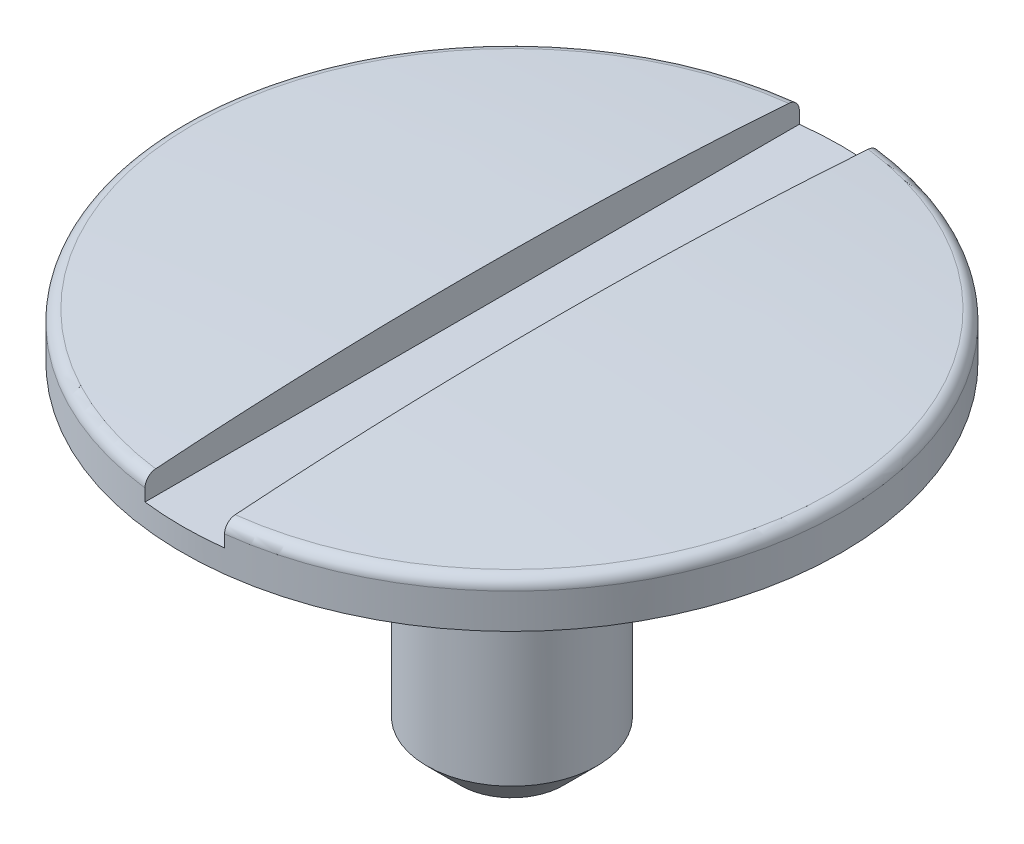
ISO-10303-21;
HEADER;
FILE_DESCRIPTION(('STEP AP214'),'2;1');
FILE_NAME('part.step','',(''),(''),'','','');
FILE_SCHEMA(('AUTOMOTIVE_DESIGN { 1 0 10303 214 1 1 1 1 }'));
ENDSEC;
DATA;
#1=APPLICATION_CONTEXT('core data for automotive mechanical design processes');
#2=APPLICATION_PROTOCOL_DEFINITION('international standard','automotive_design',2000,#1);
#3=PRODUCT_CONTEXT('',#1,'mechanical');
#4=PRODUCT('Part','Part','',(#3));
#5=PRODUCT_RELATED_PRODUCT_CATEGORY('part','',(#4));
#6=PRODUCT_DEFINITION_FORMATION('','',#4);
#7=PRODUCT_DEFINITION_CONTEXT('part definition',#1,'design');
#8=PRODUCT_DEFINITION('design','',#6,#7);
#9=PRODUCT_DEFINITION_SHAPE('','',#8);
#10=(LENGTH_UNIT() NAMED_UNIT(*) SI_UNIT(.MILLI.,.METRE.));
#11=(NAMED_UNIT(*) PLANE_ANGLE_UNIT() SI_UNIT($,.RADIAN.));
#12=(NAMED_UNIT(*) SI_UNIT($,.STERADIAN.) SOLID_ANGLE_UNIT());
#13=UNCERTAINTY_MEASURE_WITH_UNIT(LENGTH_MEASURE(1.E-05),#10,'distance_accuracy_value','');
#14=(GEOMETRIC_REPRESENTATION_CONTEXT(3) GLOBAL_UNCERTAINTY_ASSIGNED_CONTEXT((#13)) GLOBAL_UNIT_ASSIGNED_CONTEXT((#10,
#11,#12)) REPRESENTATION_CONTEXT('',''));
#15=CARTESIAN_POINT('',(0.,0.,0.));
#16=DIRECTION('',(0.,0.,1.));
#17=DIRECTION('',(1.,0.,0.));
#18=AXIS2_PLACEMENT_3D('',#15,#16,#17);
#19=CARTESIAN_POINT('',(0.,-19.7473682474656,0.));
#20=DIRECTION('',(0.,-1.,0.));
#21=DIRECTION('',(1.,0.,0.));
#22=AXIS2_PLACEMENT_3D('',#19,#20,#21);
#23=SPHERICAL_SURFACE('',#22,20.0000000000012);
#24=CARTESIAN_POINT('',(0.175000000002913,-19.7473682474656,0.));
#25=DIRECTION('',(1.,1.44957830461334E-13,0.));
#26=DIRECTION('',(-1.44957830461334E-13,1.,0.));
#27=AXIS2_PLACEMENT_3D('',#24,#25,#26);
#28=CIRCLE('',#27,19.9992343603461);
#29=CARTESIAN_POINT('',(0.175000000000021,0.203325051946489,1.39255587781734));
#30=VERTEX_POINT('',#29);
#31=CARTESIAN_POINT('',(0.175000000000021,0.203325051946445,-1.39255587781736));
#32=VERTEX_POINT('',#31);
#33=EDGE_CURVE('E109',#30,#32,#28,.F.);
#34=ORIENTED_EDGE('',*,*,#33,.F.);
#35=CARTESIAN_POINT('',(0.,0.203325051946444,0.));
#36=DIRECTION('',(0.,-1.,0.));
#37=DIRECTION('',(1.,0.,0.));
#38=AXIS2_PLACEMENT_3D('',#35,#36,#37);
#39=CIRCLE('',#38,1.40350877191546);
#40=EDGE_CURVE('E126',#30,#32,#39,.F.);
#41=ORIENTED_EDGE('',*,*,#40,.T.);
#42=EDGE_LOOP('',(#34,#41));
#43=FACE_BOUND('',#42,.T.);
#44=ADVANCED_FACE('F35',(#43),#23,.T.);
#45=CARTESIAN_POINT('',(0.,0.153448318697961,0.));
#46=DIRECTION('',(0.,-1.,0.));
#47=DIRECTION('',(1.,0.,0.));
#48=AXIS2_PLACEMENT_3D('',#45,#46,#47);
#49=TOROIDAL_SURFACE('',#48,1.39999999998568,0.05);
#50=CARTESIAN_POINT('',(0.175000000000024,0.180891636046044,-1.43113566144709));
#51=CARTESIAN_POINT('',(0.175000000000025,0.178560281061544,-1.43267770724129));
#52=CARTESIAN_POINT('',(0.175000000000025,0.176097582226159,-1.43402472347457));
#53=CARTESIAN_POINT('',(0.175000000000026,0.170979124220363,-1.43628758780099));
#54=CARTESIAN_POINT('',(0.175000000000026,0.168323150977832,-1.43720294913421));
#55=CARTESIAN_POINT('',(0.175000000000027,0.162895618780364,-1.43857383147017));
#56=CARTESIAN_POINT('',(0.175000000000028,0.160124094582384,-1.43902948972413));
#57=CARTESIAN_POINT('',(0.175000000000028,0.154544602146341,-1.43946763476279));
#58=CARTESIAN_POINT('',(0.175000000000029,0.151736642780538,-1.4394502346573));
#59=CARTESIAN_POINT('',(0.17500000000003,0.146170024697078,-1.43894369998403));
#60=CARTESIAN_POINT('',(0.17500000000003,0.14341126893163,-1.43845563124171));
#61=CARTESIAN_POINT('',(0.175000000000031,0.13801464336625,-1.43702370948892));
#62=CARTESIAN_POINT('',(0.175000000000031,0.13537677775096,-1.43607984071384));
#63=CARTESIAN_POINT('',(0.175000000000032,0.130293560142586,-1.4337627904083));
#64=CARTESIAN_POINT('',(0.175000000000032,0.127848414465937,-1.43238915640251));
#65=CARTESIAN_POINT('',(0.175000000000033,0.123221889741078,-1.42925288251512));
#66=CARTESIAN_POINT('',(0.175000000000033,0.121040516092855,-1.42749023467164));
#67=CARTESIAN_POINT('',(0.175000000000034,0.116991075627887,-1.42361656091314));
#68=CARTESIAN_POINT('',(0.175000000000034,0.115124687197054,-1.42150378071808));
#69=CARTESIAN_POINT('',(0.175000000000035,0.111770057388856,-1.41699680295985));
#70=CARTESIAN_POINT('',(0.175000000000035,0.110281829491109,-1.41460259536958));
#71=CARTESIAN_POINT('',(0.175000000000035,0.107714338923366,-1.40958218299511));
#72=CARTESIAN_POINT('',(0.175000000000035,0.10663811509622,-1.40695442408408));
#73=CARTESIAN_POINT('',(0.175000000000036,0.104938932971271,-1.40155622917851));
#74=CARTESIAN_POINT('',(0.175000000000036,0.104315992393513,-1.39878578761064));
#75=CARTESIAN_POINT('',(0.175000000000036,0.103537460797932,-1.39316193157017));
#76=CARTESIAN_POINT('',(0.175000000000036,0.103384877713837,-1.39030810041072));
#77=CARTESIAN_POINT('',(0.175000000000036,0.103559548266404,-1.38461512584935));
#78=CARTESIAN_POINT('',(0.175000000000036,0.103886812656071,-1.38177598277802));
#79=CARTESIAN_POINT('',(0.175000000000036,0.105013813089805,-1.3761849025975));
#80=CARTESIAN_POINT('',(0.175000000000035,0.105814840983795,-1.37343322568985));
#81=CARTESIAN_POINT('',(0.175000000000035,0.107868545203982,-1.36810385594301));
#82=CARTESIAN_POINT('',(0.175000000000035,0.109121219523854,-1.36552616233101));
#83=CARTESIAN_POINT('',(0.175000000000034,0.112040281181247,-1.36062493039321));
#84=CARTESIAN_POINT('',(0.175000000000034,0.11370568624035,-1.35830080722965));
#85=CARTESIAN_POINT('',(0.175000000000034,0.117405472671899,-1.35396752925418));
#86=CARTESIAN_POINT('',(0.175000000000033,0.119439841965097,-1.3519583641351));
#87=CARTESIAN_POINT('',(0.175000000000033,0.123805502865695,-1.34832671730377));
#88=CARTESIAN_POINT('',(0.175000000000032,0.126134717532373,-1.34670173917914));
#89=CARTESIAN_POINT('',(0.175000000000032,0.131034679756063,-1.34386963135274));
#90=CARTESIAN_POINT('',(0.175000000000031,0.133605416067243,-1.34266248220809));
#91=CARTESIAN_POINT('',(0.175000000000031,0.138893129670516,-1.34071036522845));
#92=CARTESIAN_POINT('',(0.17500000000003,0.141608758292212,-1.33996174364333));
#93=CARTESIAN_POINT('',(0.175000000000029,0.147127424117034,-1.33893393888391));
#94=CARTESIAN_POINT('',(0.175000000000029,0.149930458020146,-1.33865473800827));
#95=CARTESIAN_POINT('',(0.175000000000028,0.155527503093241,-1.3385744043236));
#96=CARTESIAN_POINT('',(0.175000000000028,0.158321476116973,-1.33877058680354));
#97=CARTESIAN_POINT('',(0.175000000000027,0.163836713163342,-1.33962951909531));
#98=CARTESIAN_POINT('',(0.175000000000027,0.16655797792858,-1.34029226414005));
#99=CARTESIAN_POINT('',(0.175000000000026,0.171849584425983,-1.34206416908961));
#100=CARTESIAN_POINT('',(0.175000000000025,0.174419995271844,-1.34317312270541));
#101=CARTESIAN_POINT('',(0.175000000000025,0.179339407662948,-1.34580479446419));
#102=CARTESIAN_POINT('',(0.175000000000024,0.181688405015702,-1.34732752043988));
#103=CARTESIAN_POINT('',(0.175000000000024,0.186111015737406,-1.35075096036927));
#104=CARTESIAN_POINT('',(0.175000000000023,0.188183224736419,-1.35265348818655));
#105=CARTESIAN_POINT('',(0.175000000000023,0.191981899679696,-1.35677700850719));
#106=CARTESIAN_POINT('',(0.175000000000023,0.193708351131309,-1.35899801435307));
#107=CARTESIAN_POINT('',(0.175000000000022,0.196780973781055,-1.36371412108633));
#108=CARTESIAN_POINT('',(0.175000000000022,0.198124044725907,-1.36621124184268));
#109=CARTESIAN_POINT('',(0.175000000000022,0.200375354166497,-1.37139435766703));
#110=CARTESIAN_POINT('',(0.175000000000022,0.20128357366268,-1.37408036098181));
#111=CARTESIAN_POINT('',(0.175000000000021,0.202645707273805,-1.37958580446009));
#112=CARTESIAN_POINT('',(0.175000000000021,0.203096298546881,-1.38240606709144));
#113=CARTESIAN_POINT('',(0.175000000000021,0.203519348037031,-1.38808215288261));
#114=CARTESIAN_POINT('',(0.175000000000021,0.203491812631285,-1.39093797556762));
#115=CARTESIAN_POINT('',(0.175000000000021,0.202958379659298,-1.39661400198807));
#116=CARTESIAN_POINT('',(0.175000000000021,0.20245092884452,-1.3994340599262));
#117=CARTESIAN_POINT('',(0.175000000000022,0.200968780987697,-1.40494946643022));
#118=CARTESIAN_POINT('',(0.175000000000022,0.199993969518579,-1.40764478427786));
#119=CARTESIAN_POINT('',(0.175000000000022,0.197605494651212,-1.41282894344985));
#120=CARTESIAN_POINT('',(0.175000000000022,0.196192400025502,-1.41531804710986));
#121=CARTESIAN_POINT('',(0.175000000000023,0.192966881760539,-1.42001948105551));
#122=CARTESIAN_POINT('',(0.175000000000023,0.191154951031286,-1.42223214773616));
#123=CARTESIAN_POINT('',(0.175000000000023,0.187918431007408,-1.42556201070716));
#124=CARTESIAN_POINT('',(0.175000000000024,0.186597857452183,-1.42678202620635));
#125=CARTESIAN_POINT('',(0.175000000000024,0.183833477621244,-1.42907342283929));
#126=CARTESIAN_POINT('',(0.175000000000024,0.182389671684978,-1.43014480438246));
#127=CARTESIAN_POINT('',(0.175000000000024,0.180891636046044,-1.43113566144709));
#128=B_SPLINE_CURVE_WITH_KNOTS('',3,(#50,#51,#52,#53,#54,#55,#56,#57,#58,#59,#60,#61,#62,#63,
#64,#65,#66,#67,#68,#69,#70,#71,#72,#73,#74,#75,#76,#77,#78,#79,#80,#81,#82,#83,#84,#85,#86,#87,
#88,#89,#90,#91,#92,#93,#94,#95,#96,#97,#98,#99,#100,#101,#102,#103,#104,#105,#106,#107,#108,
#109,#110,#111,#112,#113,#114,#115,#116,#117,#118,#119,#120,#121,#122,#123,#124,#125,#126,#127),
.UNSPECIFIED.,.T.,.F.,(4,2,2,2,2,2,2,2,2,2,2,2,2,2,2,2,2,2,2,2,2,2,2,2,2,2,2,2,2,2,2,2,2,2,2,2,
2,2,4),(0.,0.00837907339395287,0.0167675730710051,0.0251535674945092,0.0335375568167555,
0.0419026051341589,0.0502679427914296,0.0586421176436145,0.0670164639043773,0.0754341126133647,
0.0838520613292566,0.0923309545325715,0.100810179180546,0.10934351710766,0.117877046263093,
0.12643395247592,0.134990820677299,0.143527516309482,0.152063932515497,0.160543253791542,
0.169022180445353,0.177432633082565,0.185842768563927,0.194205518899811,0.202568183790649,
0.210926986928206,0.219285948308838,0.227685829073255,0.236086061850465,0.244552415110739,
0.253019138249669,0.261546908040078,0.270074564088494,0.278629914730998,0.287187361108461,
0.295733748383548,0.304269632143488,0.309653705020939,0.315037763068224),.UNSPECIFIED.);
#129=CARTESIAN_POINT('',(0.175000000000028,0.153448318698008,-1.4394009170341));
#130=VERTEX_POINT('',#129);
#131=EDGE_CURVE('E58',#32,#130,#128,.T.);
#132=ORIENTED_EDGE('',*,*,#131,.F.);
#133=ORIENTED_EDGE('',*,*,#40,.F.);
#134=CARTESIAN_POINT('',(0.175000000000025,0.175067090841669,1.34356634174732));
#135=CARTESIAN_POINT('',(0.175000000000026,0.172556157848946,1.34235227782851));
#136=CARTESIAN_POINT('',(0.175000000000026,0.169941282906867,1.34134869640238));
#137=CARTESIAN_POINT('',(0.175000000000027,0.164578095586884,1.33979383856907));
#138=CARTESIAN_POINT('',(0.175000000000027,0.161829636420155,1.33924307220805));
#139=CARTESIAN_POINT('',(0.175000000000028,0.156279928296398,1.33861163602454));
#140=CARTESIAN_POINT('',(0.175000000000028,0.153478697925862,1.33853080368167));
#141=CARTESIAN_POINT('',(0.175000000000029,0.147903271917639,1.33884137072952));
#142=CARTESIAN_POINT('',(0.17500000000003,0.145129070087395,1.33923265925875));
#143=CARTESIAN_POINT('',(0.17500000000003,0.139689197010661,1.3404747462751));
#144=CARTESIAN_POINT('',(0.175000000000031,0.137023395084223,1.34132497270266));
#145=CARTESIAN_POINT('',(0.175000000000032,0.131871564016762,1.34345943224581));
#146=CARTESIAN_POINT('',(0.175000000000032,0.129385543296285,1.34474368567428));
#147=CARTESIAN_POINT('',(0.175000000000033,0.124654292698374,1.34771378293724));
#148=CARTESIAN_POINT('',(0.175000000000033,0.122409924948726,1.34940099972761));
#149=CARTESIAN_POINT('',(0.175000000000034,0.118233694500287,1.35312574649911));
#150=CARTESIAN_POINT('',(0.175000000000034,0.116301842520982,1.35516328849168));
#151=CARTESIAN_POINT('',(0.175000000000034,0.112790160259404,1.35954674540898));
#152=CARTESIAN_POINT('',(0.175000000000035,0.111213024724992,1.3618948190153));
#153=CARTESIAN_POINT('',(0.175000000000035,0.108471780484804,1.36682079016142));
#154=CARTESIAN_POINT('',(0.175000000000035,0.107307688985756,1.3693986972701));
#155=CARTESIAN_POINT('',(0.175000000000035,0.105416411048964,1.37473271045428));
#156=CARTESIAN_POINT('',(0.175000000000036,0.104692691395389,1.37749004603199));
#157=CARTESIAN_POINT('',(0.175000000000036,0.103716003995072,1.38308689177576));
#158=CARTESIAN_POINT('',(0.175000000000036,0.103463051631074,1.38592640462397));
#159=CARTESIAN_POINT('',(0.175000000000036,0.103434772548715,1.39162125044477));
#160=CARTESIAN_POINT('',(0.175000000000036,0.10366170123626,1.39447659493407));
#161=CARTESIAN_POINT('',(0.175000000000036,0.10459179399141,1.40010868408785));
#162=CARTESIAN_POINT('',(0.175000000000035,0.105294960919559,1.40288542828011));
#163=CARTESIAN_POINT('',(0.175000000000035,0.10715826792202,1.40828033104081));
#164=CARTESIAN_POINT('',(0.175000000000035,0.108318282595621,1.41089853290039));
#165=CARTESIAN_POINT('',(0.175000000000035,0.111063496742903,1.41590169790733));
#166=CARTESIAN_POINT('',(0.175000000000034,0.112648687276086,1.41828666595763));
#167=CARTESIAN_POINT('',(0.175000000000034,0.116191366897031,1.42274279249504));
#168=CARTESIAN_POINT('',(0.175000000000034,0.118146991689346,1.42481543286268));
#169=CARTESIAN_POINT('',(0.175000000000033,0.122380707022045,1.42860003016995));
#170=CARTESIAN_POINT('',(0.175000000000033,0.124658785078175,1.43031200106704));
#171=CARTESIAN_POINT('',(0.175000000000032,0.129455047604575,1.43331344436886));
#172=CARTESIAN_POINT('',(0.175000000000032,0.131971371401962,1.43460589013499));
#173=CARTESIAN_POINT('',(0.175000000000031,0.137186290917626,1.43674680526891));
#174=CARTESIAN_POINT('',(0.17500000000003,0.139884879516075,1.43759529196781));
#175=CARTESIAN_POINT('',(0.17500000000003,0.145368875207367,1.43881891645228));
#176=CARTESIAN_POINT('',(0.175000000000029,0.148153604658957,1.43919709252355));
#177=CARTESIAN_POINT('',(0.175000000000028,0.153746946731911,1.43947893957385));
#178=CARTESIAN_POINT('',(0.175000000000028,0.156555558786953,1.43938262177324));
#179=CARTESIAN_POINT('',(0.175000000000027,0.162107722224546,1.4387194136826));
#180=CARTESIAN_POINT('',(0.175000000000027,0.164851449065259,1.43815399062373));
#181=CARTESIAN_POINT('',(0.175000000000026,0.170205235362731,1.43657117717517));
#182=CARTESIAN_POINT('',(0.175000000000026,0.172815294678449,1.4355537863086));
#183=CARTESIAN_POINT('',(0.175000000000025,0.177832092465727,1.43309504884698));
#184=CARTESIAN_POINT('',(0.175000000000025,0.180238529427037,1.43165308724508));
#185=CARTESIAN_POINT('',(0.175000000000024,0.184776861563309,1.42838768448682));
#186=CARTESIAN_POINT('',(0.175000000000024,0.186908750459584,1.42656423460865));
#187=CARTESIAN_POINT('',(0.175000000000023,0.19085015946654,1.4225773189605));
#188=CARTESIAN_POINT('',(0.175000000000023,0.192657863912135,1.42041205849629));
#189=CARTESIAN_POINT('',(0.175000000000022,0.19588723280272,1.41581063608749));
#190=CARTESIAN_POINT('',(0.175000000000022,0.197308881864106,1.413374463353));
#191=CARTESIAN_POINT('',(0.175000000000022,0.19973670970894,1.40828137823557));
#192=CARTESIAN_POINT('',(0.175000000000022,0.200739786888427,1.40562298728672));
#193=CARTESIAN_POINT('',(0.175000000000021,0.202288493763778,1.40017613028651));
#194=CARTESIAN_POINT('',(0.175000000000021,0.202834105517654,1.39738765913789));
#195=CARTESIAN_POINT('',(0.175000000000021,0.203455309129993,1.39174131798859));
#196=CARTESIAN_POINT('',(0.175000000000021,0.203527969275428,1.38888312515113));
#197=CARTESIAN_POINT('',(0.175000000000021,0.20319364384115,1.38319499960048));
#198=CARTESIAN_POINT('',(0.175000000000021,0.202786666749516,1.38036506638809));
#199=CARTESIAN_POINT('',(0.175000000000022,0.201502748924458,1.37480716258592));
#200=CARTESIAN_POINT('',(0.175000000000022,0.20062475804367,1.37207943446232));
#201=CARTESIAN_POINT('',(0.175000000000022,0.198421770971058,1.36680995287128));
#202=CARTESIAN_POINT('',(0.175000000000022,0.197096667322328,1.36426824428973));
#203=CARTESIAN_POINT('',(0.175000000000023,0.19403990709189,1.359450824216));
#204=CARTESIAN_POINT('',(0.175000000000023,0.192309194032555,1.35717451348824));
#205=CARTESIAN_POINT('',(0.175000000000023,0.188488877135831,1.35294953272031));
#206=CARTESIAN_POINT('',(0.175000000000024,0.186399720955243,1.35100045993137));
#207=CARTESIAN_POINT('',(0.175000000000024,0.182753424626422,1.3481379195084));
#208=CARTESIAN_POINT('',(0.175000000000024,0.181285900780818,1.34710828946503));
#209=CARTESIAN_POINT('',(0.175000000000025,0.178248900638886,1.34521229148411));
#210=CARTESIAN_POINT('',(0.175000000000025,0.176679424673388,1.34434592301684));
#211=CARTESIAN_POINT('',(0.175000000000025,0.175067090841669,1.34356634174732));
#212=B_SPLINE_CURVE_WITH_KNOTS('',3,(#134,#135,#136,#137,#138,#139,#140,#141,#142,#143,#144,
#145,#146,#147,#148,#149,#150,#151,#152,#153,#154,#155,#156,#157,#158,#159,#160,#161,#162,#163,
#164,#165,#166,#167,#168,#169,#170,#171,#172,#173,#174,#175,#176,#177,#178,#179,#180,#181,#182,
#183,#184,#185,#186,#187,#188,#189,#190,#191,#192,#193,#194,#195,#196,#197,#198,#199,#200,#201,
#202,#203,#204,#205,#206,#207,#208,#209,#210,#211),.UNSPECIFIED.,.T.,.F.,(4,2,2,2,2,2,2,2,2,2,2,
2,2,2,2,2,2,2,2,2,2,2,2,2,2,2,2,2,2,2,2,2,2,2,2,2,2,2,4),(0.,0.00836061225485666,
0.0167306289637,0.025097750842039,0.0334629083690153,0.0418176628436744,0.0501728083830814,
0.0585568377831628,0.0669411546997118,0.0753871630109144,0.0838335231274777,0.0923455439902202,
0.100857842986018,0.109410238059464,0.11796268450365,0.126512785010478,0.135062705741898,
0.143570688386908,0.152078341722883,0.160524309591593,0.16896994772522,0.177360737322396,
0.185751328503124,0.194115774742446,0.202480229807466,0.21085686121662,0.219233684158382,
0.227656050075539,0.23607875155941,0.244562801886651,0.253047184946369,0.261584110968788,
0.270120885916571,0.278676773590984,0.28723471901214,0.295772951277712,0.304300596814887,
0.309669175654578,0.315037737074358),.UNSPECIFIED.);
#213=CARTESIAN_POINT('',(0.175000000000028,0.153448318698118,1.43940091703489));
#214=VERTEX_POINT('',#213);
#215=EDGE_CURVE('E160',#214,#30,#212,.T.);
#216=ORIENTED_EDGE('',*,*,#215,.F.);
#217=CARTESIAN_POINT('',(0.,0.153448318698013,0.));
#218=DIRECTION('',(0.,-1.,0.));
#219=DIRECTION('',(1.,0.,0.));
#220=AXIS2_PLACEMENT_3D('',#217,#218,#219);
#221=CIRCLE('',#220,1.44999999998568);
#222=EDGE_CURVE('E123',#130,#214,#221,.T.);
#223=ORIENTED_EDGE('',*,*,#222,.F.);
#224=EDGE_LOOP('',(#132,#133,#216,#223));
#225=FACE_BOUND('',#224,.T.);
#226=ADVANCED_FACE('F176',(#225),#49,.T.);
#227=CARTESIAN_POINT('',(-0.175000000002913,-19.7473682474656,0.));
#228=DIRECTION('',(-1.,1.44957830461334E-13,0.));
#229=DIRECTION('',(-1.44957830461334E-13,-1.,0.));
#230=AXIS2_PLACEMENT_3D('',#227,#228,#229);
#231=CIRCLE('',#230,19.9992343603461);
#232=CARTESIAN_POINT('',(-0.175000000000021,0.203325051946444,-1.39255587781736));
#233=VERTEX_POINT('',#232);
#234=CARTESIAN_POINT('',(-0.175000000000021,0.203325051946444,1.39255587781735));
#235=VERTEX_POINT('',#234);
#236=EDGE_CURVE('E50',#233,#235,#231,.F.);
#237=ORIENTED_EDGE('',*,*,#236,.F.);
#238=EDGE_CURVE('E129',#233,#235,#39,.F.);
#239=ORIENTED_EDGE('',*,*,#238,.T.);
#240=EDGE_LOOP('',(#237,#239));
#241=FACE_BOUND('',#240,.T.);
#242=ADVANCED_FACE('F171',(#241),#23,.T.);
#243=CARTESIAN_POINT('',(2.96201993591808E-12,-848.356227187947,0.));
#244=DIRECTION('',(0.,-1.,0.));
#245=DIRECTION('',(1.,0.,0.));
#246=AXIS2_PLACEMENT_3D('',#243,#244,#245);
#247=CYLINDRICAL_SURFACE('',#246,1.44999999998568);
#248=DIRECTION('',(0.,-1.,0.));
#249=VECTOR('',#248,1.);
#250=CARTESIAN_POINT('',(-0.175000000123027,-848.356227187947,-1.43940091701873));
#251=LINE('',#250,#249);
#252=CARTESIAN_POINT('',(-0.175000000000036,0.1,-1.43940091701873));
#253=VERTEX_POINT('',#252);
#254=CARTESIAN_POINT('',(-0.175000000000028,0.153448318698012,-1.43940091703404));
#255=VERTEX_POINT('',#254);
#256=EDGE_CURVE('E97',#253,#255,#251,.F.);
#257=ORIENTED_EDGE('',*,*,#256,.F.);
#258=CARTESIAN_POINT('',(0.,0.099999999999989,0.));
#259=DIRECTION('',(0.,-1.,0.));
#260=DIRECTION('',(0.,0.,-1.));
#261=AXIS2_PLACEMENT_3D('',#258,#259,#260);
#262=CIRCLE('',#261,1.44999999998568);
#263=CARTESIAN_POINT('',(0.175000000000036,0.099999999999989,-1.43940091703404));
#264=VERTEX_POINT('',#263);
#265=EDGE_CURVE('E11',#264,#253,#262,.F.);
#266=ORIENTED_EDGE('',*,*,#265,.F.);
#267=DIRECTION('',(0.,-1.,0.));
#268=VECTOR('',#267,1.);
#269=CARTESIAN_POINT('',(0.175000000123027,-848.356227187947,-1.43940091701945));
#270=LINE('',#269,#268);
#271=EDGE_CURVE('E115',#130,#264,#270,.T.);
#272=ORIENTED_EDGE('',*,*,#271,.F.);
#273=ORIENTED_EDGE('',*,*,#222,.T.);
#274=DIRECTION('',(0.,-1.,0.));
#275=VECTOR('',#274,1.);
#276=CARTESIAN_POINT('',(0.175000000123027,-848.356227187947,1.43940091701945));
#277=LINE('',#276,#275);
#278=CARTESIAN_POINT('',(0.175000000000036,0.099999999999989,1.43940091703404));
#279=VERTEX_POINT('',#278);
#280=EDGE_CURVE('E107',#279,#214,#277,.F.);
#281=ORIENTED_EDGE('',*,*,#280,.F.);
#282=CARTESIAN_POINT('',(-0.175000000000036,0.1,1.43940091701873));
#283=VERTEX_POINT('',#282);
#284=EDGE_CURVE('E39',#283,#279,#262,.F.);
#285=ORIENTED_EDGE('',*,*,#284,.F.);
#286=DIRECTION('',(0.,-1.,0.));
#287=VECTOR('',#286,1.);
#288=CARTESIAN_POINT('',(-0.175000000123027,-848.356227187947,1.43940091701873));
#289=LINE('',#288,#287);
#290=CARTESIAN_POINT('',(-0.175000000000028,0.153448318700749,1.43940091703412));
#291=VERTEX_POINT('',#290);
#292=EDGE_CURVE('E100',#291,#283,#289,.T.);
#293=ORIENTED_EDGE('',*,*,#292,.F.);
#294=EDGE_CURVE('E106',#291,#255,#221,.T.);
#295=ORIENTED_EDGE('',*,*,#294,.T.);
#296=EDGE_LOOP('',(#257,#266,#272,#273,#281,#285,#293,#295));
#297=FACE_BOUND('',#296,.T.);
#298=CARTESIAN_POINT('',(0.,0.,0.));
#299=DIRECTION('',(0.,-1.,0.));
#300=DIRECTION('',(1.,0.,0.));
#301=AXIS2_PLACEMENT_3D('',#298,#299,#300);
#302=CIRCLE('',#301,1.44999999998281);
#303=CARTESIAN_POINT('',(1.44999999998281,0.,0.));
#304=VERTEX_POINT('',#303);
#305=EDGE_CURVE('E117',#304,#304,#302,.T.);
#306=ORIENTED_EDGE('',*,*,#305,.F.);
#307=EDGE_LOOP('',(#306));
#308=FACE_BOUND('',#307,.T.);
#309=ADVANCED_FACE('F103',(#297,#308),#247,.T.);
#310=CARTESIAN_POINT('',(0.,0.,0.));
#311=DIRECTION('',(0.,-1.,0.));
#312=DIRECTION('',(1.,0.,0.));
#313=AXIS2_PLACEMENT_3D('',#310,#311,#312);
#314=PLANE('',#313);
#315=CARTESIAN_POINT('',(0.,0.,0.));
#316=DIRECTION('',(0.,-1.,0.));
#317=DIRECTION('',(1.,0.,0.));
#318=AXIS2_PLACEMENT_3D('',#315,#316,#317);
#319=CIRCLE('',#318,0.375);
#320=CARTESIAN_POINT('',(0.375,0.,0.));
#321=VERTEX_POINT('',#320);
#322=EDGE_CURVE('E120',#321,#321,#319,.T.);
#323=ORIENTED_EDGE('',*,*,#322,.F.);
#324=EDGE_LOOP('',(#323));
#325=FACE_BOUND('',#324,.T.);
#326=ORIENTED_EDGE('',*,*,#305,.T.);
#327=EDGE_LOOP('',(#326));
#328=FACE_BOUND('',#327,.T.);
#329=ADVANCED_FACE('F188',(#325,#328),#314,.T.);
#330=CARTESIAN_POINT('',(0.,-1.5,0.));
#331=DIRECTION('',(0.,1.,0.));
#332=DIRECTION('',(0.,0.,1.));
#333=AXIS2_PLACEMENT_3D('',#330,#331,#332);
#334=CYLINDRICAL_SURFACE('',#333,0.375);
#335=CARTESIAN_POINT('',(0.,-1.35,0.));
#336=DIRECTION('',(0.,1.,0.));
#337=DIRECTION('',(0.,0.,1.));
#338=AXIS2_PLACEMENT_3D('',#335,#336,#337);
#339=CIRCLE('',#338,0.375);
#340=CARTESIAN_POINT('',(0.,-1.35,0.375));
#341=VERTEX_POINT('',#340);
#342=EDGE_CURVE('E130',#341,#341,#339,.T.);
#343=ORIENTED_EDGE('',*,*,#342,.T.);
#344=EDGE_LOOP('',(#343));
#345=FACE_BOUND('',#344,.T.);
#346=ORIENTED_EDGE('',*,*,#322,.T.);
#347=EDGE_LOOP('',(#346));
#348=FACE_BOUND('',#347,.T.);
#349=ADVANCED_FACE('F192',(#345,#348),#334,.T.);
#350=CARTESIAN_POINT('',(0.,-1.5,0.));
#351=DIRECTION('',(0.,1.,0.));
#352=DIRECTION('',(0.,0.,1.));
#353=AXIS2_PLACEMENT_3D('',#350,#351,#352);
#354=PLANE('',#353);
#355=CARTESIAN_POINT('',(0.,-1.5,0.));
#356=DIRECTION('',(0.,1.,0.));
#357=DIRECTION('',(0.,0.,1.));
#358=AXIS2_PLACEMENT_3D('',#355,#356,#357);
#359=CIRCLE('',#358,0.224999999999999);
#360=CARTESIAN_POINT('',(0.,-1.5,0.224999999999999));
#361=VERTEX_POINT('',#360);
#362=EDGE_CURVE('E133',#361,#361,#359,.F.);
#363=ORIENTED_EDGE('',*,*,#362,.T.);
#364=EDGE_LOOP('',(#363));
#365=FACE_BOUND('',#364,.T.);
#366=ADVANCED_FACE('F157',(#365),#354,.F.);
#367=CARTESIAN_POINT('',(-0.175000000000024,0.180891636046044,-1.43113566144709));
#368=CARTESIAN_POINT('',(-0.175000000000024,0.183245146175823,-1.42957865814561));
#369=CARTESIAN_POINT('',(-0.175000000000024,0.185468214655313,-1.42782059027519));
#370=CARTESIAN_POINT('',(-0.175000000000023,0.189588780622375,-1.42395399521058));
#371=CARTESIAN_POINT('',(-0.175000000000023,0.191485855487181,-1.42184501995964));
#372=CARTESIAN_POINT('',(-0.175000000000022,0.19489832449156,-1.41734050037786));
#373=CARTESIAN_POINT('',(-0.175000000000022,0.196414019684757,-1.41494518429622));
#374=CARTESIAN_POINT('',(-0.175000000000022,0.199023765533317,-1.40993586938822));
#375=CARTESIAN_POINT('',(-0.175000000000022,0.200117920150735,-1.40732192467474));
#376=CARTESIAN_POINT('',(-0.175000000000021,0.201860586806894,-1.40193390635059));
#377=CARTESIAN_POINT('',(-0.175000000000021,0.202506668002042,-1.39915904643895));
#378=CARTESIAN_POINT('',(-0.175000000000021,0.203326376098828,-1.39354026424632));
#379=CARTESIAN_POINT('',(-0.175000000000021,0.203499968427231,-1.39069633692685));
#380=CARTESIAN_POINT('',(-0.175000000000021,0.203369781384107,-1.38500536118466));
#381=CARTESIAN_POINT('',(-0.175000000000021,0.203063647460291,-1.38215836633464));
#382=CARTESIAN_POINT('',(-0.175000000000021,0.201977990364129,-1.37655606909352));
#383=CARTESIAN_POINT('',(-0.175000000000022,0.201198462959194,-1.37380076752246));
#384=CARTESIAN_POINT('',(-0.175000000000022,0.199186898737186,-1.3684593851795));
#385=CARTESIAN_POINT('',(-0.175000000000022,0.197954696444945,-1.36587336669677));
#386=CARTESIAN_POINT('',(-0.175000000000022,0.195071680046816,-1.36094621107579));
#387=CARTESIAN_POINT('',(-0.175000000000023,0.193420874668266,-1.35860506883363));
#388=CARTESIAN_POINT('',(-0.175000000000023,0.18975521363733,-1.35424629047737));
#389=CARTESIAN_POINT('',(-0.175000000000023,0.187742093979376,-1.35222719474485));
#390=CARTESIAN_POINT('',(-0.175000000000024,0.183403102412896,-1.34855887108132));
#391=CARTESIAN_POINT('',(-0.175000000000024,0.181077243256788,-1.34690962807633));
#392=CARTESIAN_POINT('',(-0.175000000000025,0.176198220572337,-1.34404164268271));
#393=CARTESIAN_POINT('',(-0.175000000000026,0.173646975787383,-1.34281963618264));
#394=CARTESIAN_POINT('',(-0.175000000000026,0.168374503349626,-1.34082492972899));
#395=CARTESIAN_POINT('',(-0.175000000000027,0.165653283452889,-1.34005220929078));
#396=CARTESIAN_POINT('',(-0.175000000000028,0.160139650361024,-1.3389833929124));
#397=CARTESIAN_POINT('',(-0.175000000000028,0.157347909298497,-1.33868382776914));
#398=CARTESIAN_POINT('',(-0.175000000000029,0.151753903237082,-1.33855940210955));
#399=CARTESIAN_POINT('',(-0.175000000000029,0.148951638514065,-1.33873452923501));
#400=CARTESIAN_POINT('',(-0.17500000000003,0.143426022912686,-1.33955280663568));
#401=CARTESIAN_POINT('',(-0.17500000000003,0.140702438008793,-1.34019437838027));
#402=CARTESIAN_POINT('',(-0.175000000000031,0.135401274168418,-1.34192467402709));
#403=CARTESIAN_POINT('',(-0.175000000000031,0.132823695882744,-1.34301339992226));
#404=CARTESIAN_POINT('',(-0.175000000000032,0.127881062371418,-1.34560889856114));
#405=CARTESIAN_POINT('',(-0.175000000000033,0.125516497914748,-1.34711660555631));
#406=CARTESIAN_POINT('',(-0.175000000000033,0.121071860831305,-1.35050510514726));
#407=CARTESIAN_POINT('',(-0.175000000000033,0.11899179719771,-1.35238590953218));
#408=CARTESIAN_POINT('',(-0.175000000000034,0.115159996023456,-1.35648050653083));
#409=CARTESIAN_POINT('',(-0.175000000000034,0.113410563493263,-1.35869645597305));
#410=CARTESIAN_POINT('',(-0.175000000000035,0.110305035659722,-1.36338865900591));
#411=CARTESIAN_POINT('',(-0.175000000000035,0.10894895737954,-1.36586492385587));
#412=CARTESIAN_POINT('',(-0.175000000000035,0.106657378111048,-1.37102878830448));
#413=CARTESIAN_POINT('',(-0.175000000000035,0.105725334766836,-1.373717922521));
#414=CARTESIAN_POINT('',(-0.175000000000036,0.104323069037552,-1.37921403486717));
#415=CARTESIAN_POINT('',(-0.175000000000036,0.10385286342028,-1.38202101727163));
#416=CARTESIAN_POINT('',(-0.175000000000036,0.103385676901511,-1.38769014963537));
#417=CARTESIAN_POINT('',(-0.175000000000036,0.103391389579916,-1.3905525219228));
#418=CARTESIAN_POINT('',(-0.175000000000036,0.103882763062926,-1.39623581035699));
#419=CARTESIAN_POINT('',(-0.175000000000036,0.104368429517785,-1.3990567260153));
#420=CARTESIAN_POINT('',(-0.175000000000035,0.105807369404984,-1.40457951914757));
#421=CARTESIAN_POINT('',(-0.175000000000035,0.106761074042997,-1.40728128434122));
#422=CARTESIAN_POINT('',(-0.175000000000035,0.10911030638354,-1.41248543196174));
#423=CARTESIAN_POINT('',(-0.175000000000035,0.110505828158897,-1.41498781706281));
#424=CARTESIAN_POINT('',(-0.175000000000034,0.11369367852166,-1.4197110913627));
#425=CARTESIAN_POINT('',(-0.175000000000034,0.115484401746047,-1.4219330638195));
#426=CARTESIAN_POINT('',(-0.175000000000033,0.119415860238713,-1.42604219148294));
#427=CARTESIAN_POINT('',(-0.175000000000033,0.121556583566387,-1.42792935810724));
#428=CARTESIAN_POINT('',(-0.175000000000032,0.126111388096289,-1.43130118146139));
#429=CARTESIAN_POINT('',(-0.175000000000032,0.128523463197131,-1.43278854803238));
#430=CARTESIAN_POINT('',(-0.175000000000031,0.133564332959338,-1.43533385978036));
#431=CARTESIAN_POINT('',(-0.175000000000031,0.136193110194246,-1.43639183944675));
#432=CARTESIAN_POINT('',(-0.17500000000003,0.141572910580311,-1.43804100000422));
#433=CARTESIAN_POINT('',(-0.17500000000003,0.144322942525437,-1.43863541559851));
#434=CARTESIAN_POINT('',(-0.175000000000029,0.149884608756212,-1.43935213307851));
#435=CARTESIAN_POINT('',(-0.175000000000029,0.152696256710534,-1.43947432912041));
#436=CARTESIAN_POINT('',(-0.175000000000028,0.158289538548003,-1.43924324835924));
#437=CARTESIAN_POINT('',(-0.175000000000027,0.161071243821245,-1.43889167097958));
#438=CARTESIAN_POINT('',(-0.175000000000027,0.166533684299149,-1.43772652925779));
#439=CARTESIAN_POINT('',(-0.175000000000026,0.169214538966182,-1.43691353112332));
#440=CARTESIAN_POINT('',(-0.175000000000026,0.173397440779251,-1.43525039404146));
#441=CARTESIAN_POINT('',(-0.175000000000025,0.174954835601789,-1.43453590050758));
#442=CARTESIAN_POINT('',(-0.175000000000025,0.177988034915014,-1.43295082505942));
#443=CARTESIAN_POINT('',(-0.175000000000025,0.17946383965127,-1.43208024361497));
#444=CARTESIAN_POINT('',(-0.175000000000024,0.180891636046044,-1.43113566144709));
#445=B_SPLINE_CURVE_WITH_KNOTS('',3,(#367,#368,#369,#370,#371,#372,#373,#374,#375,#376,#377,
#378,#379,#380,#381,#382,#383,#384,#385,#386,#387,#388,#389,#390,#391,#392,#393,#394,#395,#396,
#397,#398,#399,#400,#401,#402,#403,#404,#405,#406,#407,#408,#409,#410,#411,#412,#413,#414,#415,
#416,#417,#418,#419,#420,#421,#422,#423,#424,#425,#426,#427,#428,#429,#430,#431,#432,#433,#434,
#435,#436,#437,#438,#439,#440,#441,#442,#443,#444),.UNSPECIFIED.,.T.,.F.,(4,2,2,2,2,2,2,2,2,2,2,
2,2,2,2,2,2,2,2,2,2,2,2,2,2,2,2,2,2,2,2,2,2,2,2,2,2,2,4),(0.,0.00845947261381736,
0.0169298307987472,0.0253934815235086,0.0338550435700035,0.0423621587299338,0.0508698963607686,
0.0594195219212486,0.0679692239246541,0.0765220543839314,0.0850747065423118,0.0935874205782733,
0.10209978760092,0.110545620477339,0.118991068246535,0.127374301160515,0.135757315826122,
0.144112092172698,0.152466905756734,0.160840500638811,0.169214360152233,0.177644603088571,
0.186075210805551,0.194573382263658,0.203071862250853,0.211618444783638,0.220165127932238,
0.228719700002417,0.23727415731408,0.245794484710806,0.254314521488615,0.262775263573696,
0.271235325936779,0.279635813080006,0.288038183008569,0.29641049375583,0.304772553016528,
0.309904649412704,0.315036730361443),.UNSPECIFIED.);
#446=EDGE_CURVE('E141',#255,#233,#445,.T.);
#447=ORIENTED_EDGE('',*,*,#446,.F.);
#448=ORIENTED_EDGE('',*,*,#294,.F.);
#449=CARTESIAN_POINT('',(-0.175000000000025,0.175067090841669,1.34356634174732));
#450=CARTESIAN_POINT('',(-0.175000000000025,0.177601634880067,1.34479210412758));
#451=CARTESIAN_POINT('',(-0.175000000000025,0.180033960001328,1.34623415073661));
#452=CARTESIAN_POINT('',(-0.175000000000024,0.184623311283032,1.34950824322784));
#453=CARTESIAN_POINT('',(-0.175000000000024,0.186779978952231,1.35134078885997));
#454=CARTESIAN_POINT('',(-0.175000000000023,0.190754070704036,1.3553399632431));
#455=CARTESIAN_POINT('',(-0.175000000000023,0.192571772521511,1.35750631580429));
#456=CARTESIAN_POINT('',(-0.175000000000022,0.195819687238919,1.36211124582551));
#457=CARTESIAN_POINT('',(-0.175000000000022,0.19724999452784,1.36454975676911));
#458=CARTESIAN_POINT('',(-0.175000000000022,0.199692623159323,1.36964587064869));
#459=CARTESIAN_POINT('',(-0.175000000000022,0.200702386124819,1.37230469990102));
#460=CARTESIAN_POINT('',(-0.175000000000021,0.202264260878997,1.37775367101632));
#461=CARTESIAN_POINT('',(-0.175000000000021,0.202816337408834,1.38054382297851));
#462=CARTESIAN_POINT('',(-0.175000000000021,0.203449763157484,1.38619400877083));
#463=CARTESIAN_POINT('',(-0.175000000000021,0.203528278390251,1.38905436066358));
#464=CARTESIAN_POINT('',(-0.175000000000021,0.203204738055843,1.39474779192876));
#465=CARTESIAN_POINT('',(-0.175000000000021,0.202802675912263,1.39758087092744));
#466=CARTESIAN_POINT('',(-0.175000000000022,0.201527817715506,1.40314325411102));
#467=CARTESIAN_POINT('',(-0.175000000000022,0.200654372316191,1.40587240957278));
#468=CARTESIAN_POINT('',(-0.175000000000022,0.19846007280553,1.41114455630845));
#469=CARTESIAN_POINT('',(-0.175000000000022,0.197139225419435,1.41368755038));
#470=CARTESIAN_POINT('',(-0.175000000000023,0.194092113248477,1.41850497457802));
#471=CARTESIAN_POINT('',(-0.175000000000023,0.192367328746131,1.42078034078569));
#472=CARTESIAN_POINT('',(-0.175000000000023,0.188557823788917,1.42500669723618));
#473=CARTESIAN_POINT('',(-0.175000000000024,0.186473115438264,1.42695769838303));
#474=CARTESIAN_POINT('',(-0.175000000000024,0.1820180854933,1.43046557674846));
#475=CARTESIAN_POINT('',(-0.175000000000025,0.179649812160618,1.43202505514176));
#476=CARTESIAN_POINT('',(-0.175000000000025,0.174683600994688,1.43472096536138));
#477=CARTESIAN_POINT('',(-0.175000000000026,0.172085672657897,1.43585741467024));
#478=CARTESIAN_POINT('',(-0.175000000000027,0.166753653613356,1.43766686636495));
#479=CARTESIAN_POINT('',(-0.175000000000027,0.164020654516177,1.43834308614851));
#480=CARTESIAN_POINT('',(-0.175000000000028,0.158479770503276,1.43922483177006));
#481=CARTESIAN_POINT('',(-0.175000000000028,0.155671887812569,1.43943037157763));
#482=CARTESIAN_POINT('',(-0.175000000000029,0.150074102517257,1.43936479432936));
#483=CARTESIAN_POINT('',(-0.175000000000029,0.147284175144606,1.4390957694349));
#484=CARTESIAN_POINT('',(-0.17500000000003,0.141789141886287,1.43809309524229));
#485=CARTESIAN_POINT('',(-0.175000000000031,0.139084035371802,1.43735944938945));
#486=CARTESIAN_POINT('',(-0.175000000000031,0.133835152577802,1.43544917907959));
#487=CARTESIAN_POINT('',(-0.175000000000032,0.131291373758234,1.43427256159904));
#488=CARTESIAN_POINT('',(-0.175000000000032,0.126436300142272,1.4315107354197));
#489=CARTESIAN_POINT('',(-0.175000000000033,0.124125009353732,1.42992551967876));
#490=CARTESIAN_POINT('',(-0.175000000000033,0.119789427760295,1.42638457648963));
#491=CARTESIAN_POINT('',(-0.175000000000034,0.117766426774678,1.4244272700603));
#492=CARTESIAN_POINT('',(-0.175000000000034,0.114074961313065,1.42020289484204));
#493=CARTESIAN_POINT('',(-0.175000000000034,0.112406509176307,1.41793581527671));
#494=CARTESIAN_POINT('',(-0.175000000000035,0.109458992513398,1.41313933450241));
#495=CARTESIAN_POINT('',(-0.175000000000035,0.10818273506982,1.41060820834382));
#496=CARTESIAN_POINT('',(-0.175000000000035,0.106069957744657,1.40536864547964));
#497=CARTESIAN_POINT('',(-0.175000000000035,0.105233455363816,1.40266020172224));
#498=CARTESIAN_POINT('',(-0.175000000000036,0.104018328842871,1.39712296708515));
#499=CARTESIAN_POINT('',(-0.175000000000036,0.103642883749184,1.39429347832423));
#500=CARTESIAN_POINT('',(-0.175000000000036,0.103370371198427,1.38861153249208));
#501=CARTESIAN_POINT('',(-0.175000000000036,0.103473316473458,1.38575907481156));
#502=CARTESIAN_POINT('',(-0.175000000000036,0.104156010697789,1.38010076582265));
#503=CARTESIAN_POINT('',(-0.175000000000036,0.104737564639843,1.37729513203733));
#504=CARTESIAN_POINT('',(-0.175000000000035,0.10636394409124,1.37182145296135));
#505=CARTESIAN_POINT('',(-0.175000000000035,0.107408771615954,1.3691534082693));
#506=CARTESIAN_POINT('',(-0.175000000000035,0.109931628684279,1.36403438665374));
#507=CARTESIAN_POINT('',(-0.175000000000035,0.111409160344082,1.36158316444446));
#508=CARTESIAN_POINT('',(-0.175000000000034,0.114757066396075,1.35696546293372));
#509=CARTESIAN_POINT('',(-0.175000000000034,0.116627430956051,1.35479897650781));
#510=CARTESIAN_POINT('',(-0.175000000000033,0.120696578053263,1.35082622334201));
#511=CARTESIAN_POINT('',(-0.175000000000033,0.122893374471638,1.34901792263253));
#512=CARTESIAN_POINT('',(-0.175000000000032,0.127561375638576,1.34579946054257));
#513=CARTESIAN_POINT('',(-0.175000000000032,0.130032557066825,1.34438926536265));
#514=CARTESIAN_POINT('',(-0.175000000000031,0.135157493786466,1.34201908721952));
#515=CARTESIAN_POINT('',(-0.175000000000031,0.137809586159128,1.34105550800612));
#516=CARTESIAN_POINT('',(-0.17500000000003,0.143239239177258,1.33959036707827));
#517=CARTESIAN_POINT('',(-0.17500000000003,0.146016826198256,1.33908890296605));
#518=CARTESIAN_POINT('',(-0.175000000000029,0.151599560059721,1.33856501988213));
#519=CARTESIAN_POINT('',(-0.175000000000028,0.154404439133314,1.33853972596745));
#520=CARTESIAN_POINT('',(-0.175000000000028,0.159976002619435,1.33896179573472));
#521=CARTESIAN_POINT('',(-0.175000000000027,0.162742730115278,1.33940857283488));
#522=CARTESIAN_POINT('',(-0.175000000000026,0.167107814503019,1.34049687567487));
#523=CARTESIAN_POINT('',(-0.175000000000026,0.168743130893495,1.34099566009447));
#524=CARTESIAN_POINT('',(-0.175000000000026,0.171953871458242,1.34215853742647));
#525=CARTESIAN_POINT('',(-0.175000000000026,0.173529295900001,1.34282262960047));
#526=CARTESIAN_POINT('',(-0.175000000000025,0.175067090841669,1.34356634174732));
#527=B_SPLINE_CURVE_WITH_KNOTS('',3,(#449,#450,#451,#452,#453,#454,#455,#456,#457,#458,#459,
#460,#461,#462,#463,#464,#465,#466,#467,#468,#469,#470,#471,#472,#473,#474,#475,#476,#477,#478,
#479,#480,#481,#482,#483,#484,#485,#486,#487,#488,#489,#490,#491,#492,#493,#494,#495,#496,#497,
#498,#499,#500,#501,#502,#503,#504,#505,#506,#507,#508,#509,#510,#511,#512,#513,#514,#515,#516,
#517,#518,#519,#520,#521,#522,#523,#524,#525,#526),.UNSPECIFIED.,.T.,.F.,(4,2,2,2,2,2,2,2,2,2,2,
2,2,2,2,2,2,2,2,2,2,2,2,2,2,2,2,2,2,2,2,2,2,2,2,2,2,2,4),(0.,0.0084398641346356,
0.0168905949502175,0.0253343708603596,0.0337760875831991,0.0422684346309832,0.0507614358439434,
0.0593052126468733,0.0678491063674378,0.0764047997402214,0.0849603645113529,0.0934850537493285,
0.102009456358428,0.110475629866172,0.118941453453029,0.127347468452697,0.135753233962213,
0.144122034453101,0.152490772887642,0.160859379526416,0.169228130406675,0.177633220874318,
0.186038603813488,0.19450281659582,0.202967366199313,0.211489958017946,0.220012776662051,
0.228567885787494,0.237123032130476,0.24566837305601,0.254213500125693,0.26270861709827,
0.271203012612393,0.279627767378507,0.288054301109334,0.296429942058791,0.304795187904392,
0.309915966297191,0.315036721816912),.UNSPECIFIED.);
#528=EDGE_CURVE('E136',#235,#291,#527,.T.);
#529=ORIENTED_EDGE('',*,*,#528,.F.);
#530=ORIENTED_EDGE('',*,*,#238,.F.);
#531=EDGE_LOOP('',(#447,#448,#529,#530));
#532=FACE_BOUND('',#531,.T.);
#533=ADVANCED_FACE('F145',(#532),#49,.T.);
#534=CARTESIAN_POINT('',(0.,-1.35,0.));
#535=DIRECTION('',(0.,1.,0.));
#536=DIRECTION('',(0.,0.,1.));
#537=AXIS2_PLACEMENT_3D('',#534,#535,#536);
#538=CONICAL_SURFACE('',#537,0.375,0.785398163397453);
#539=ORIENTED_EDGE('',*,*,#362,.F.);
#540=EDGE_LOOP('',(#539));
#541=FACE_BOUND('',#540,.T.);
#542=ORIENTED_EDGE('',*,*,#342,.F.);
#543=EDGE_LOOP('',(#542));
#544=FACE_BOUND('',#543,.T.);
#545=ADVANCED_FACE('F37',(#541,#544),#538,.T.);
#546=CARTESIAN_POINT('',(0.175,0.349999999999961,-1.44999999998567));
#547=DIRECTION('',(1.,1.44957830461334E-13,0.));
#548=DIRECTION('',(-1.44957830461334E-13,1.,0.));
#549=AXIS2_PLACEMENT_3D('',#546,#547,#548);
#550=PLANE('',#549);
#551=ORIENTED_EDGE('',*,*,#271,.T.);
#552=DIRECTION('',(0.,0.,1.));
#553=VECTOR('',#552,1.);
#554=CARTESIAN_POINT('',(0.175000000000036,0.1,-1.44999999998567));
#555=LINE('',#554,#553);
#556=EDGE_CURVE('E92',#264,#279,#555,.T.);
#557=ORIENTED_EDGE('',*,*,#556,.T.);
#558=ORIENTED_EDGE('',*,*,#280,.T.);
#559=ORIENTED_EDGE('',*,*,#215,.T.);
#560=ORIENTED_EDGE('',*,*,#33,.T.);
#561=ORIENTED_EDGE('',*,*,#131,.T.);
#562=EDGE_LOOP('',(#551,#557,#558,#559,#560,#561));
#563=FACE_BOUND('',#562,.T.);
#564=ADVANCED_FACE('F152',(#563),#550,.F.);
#565=CARTESIAN_POINT('',(0.175000000000036,0.1,-1.44999999998567));
#566=DIRECTION('',(0.,-1.,0.));
#567=DIRECTION('',(0.,0.,-1.));
#568=AXIS2_PLACEMENT_3D('',#565,#566,#567);
#569=PLANE('',#568);
#570=DIRECTION('',(0.,0.,1.));
#571=VECTOR('',#570,1.);
#572=CARTESIAN_POINT('',(-0.175000000000036,0.1,-1.44999999998567));
#573=LINE('',#572,#571);
#574=EDGE_CURVE('E90',#253,#283,#573,.T.);
#575=ORIENTED_EDGE('',*,*,#574,.T.);
#576=ORIENTED_EDGE('',*,*,#284,.T.);
#577=ORIENTED_EDGE('',*,*,#556,.F.);
#578=ORIENTED_EDGE('',*,*,#265,.T.);
#579=EDGE_LOOP('',(#575,#576,#577,#578));
#580=FACE_BOUND('',#579,.T.);
#581=ADVANCED_FACE('F89',(#580),#569,.F.);
#582=CARTESIAN_POINT('',(-0.175,0.349999999999961,-1.44999999998567));
#583=DIRECTION('',(-1.,1.44957830461334E-13,0.));
#584=DIRECTION('',(-1.44957830461334E-13,-1.,0.));
#585=AXIS2_PLACEMENT_3D('',#582,#583,#584);
#586=PLANE('',#585);
#587=ORIENTED_EDGE('',*,*,#256,.T.);
#588=ORIENTED_EDGE('',*,*,#446,.T.);
#589=ORIENTED_EDGE('',*,*,#236,.T.);
#590=ORIENTED_EDGE('',*,*,#528,.T.);
#591=ORIENTED_EDGE('',*,*,#292,.T.);
#592=ORIENTED_EDGE('',*,*,#574,.F.);
#593=EDGE_LOOP('',(#587,#588,#589,#590,#591,#592));
#594=FACE_BOUND('',#593,.T.);
#595=ADVANCED_FACE('F96',(#594),#586,.F.);
#596=CLOSED_SHELL('',(#44,#226,#242,#309,#329,#349,#366,#533,#545,#564,#581,#595));
#597=MANIFOLD_SOLID_BREP('B2',#596);
#598=ADVANCED_BREP_SHAPE_REPRESENTATION('',(#18,#597),#14);
#599=SHAPE_DEFINITION_REPRESENTATION(#9,#598);
ENDSEC;
END-ISO-10303-21;
